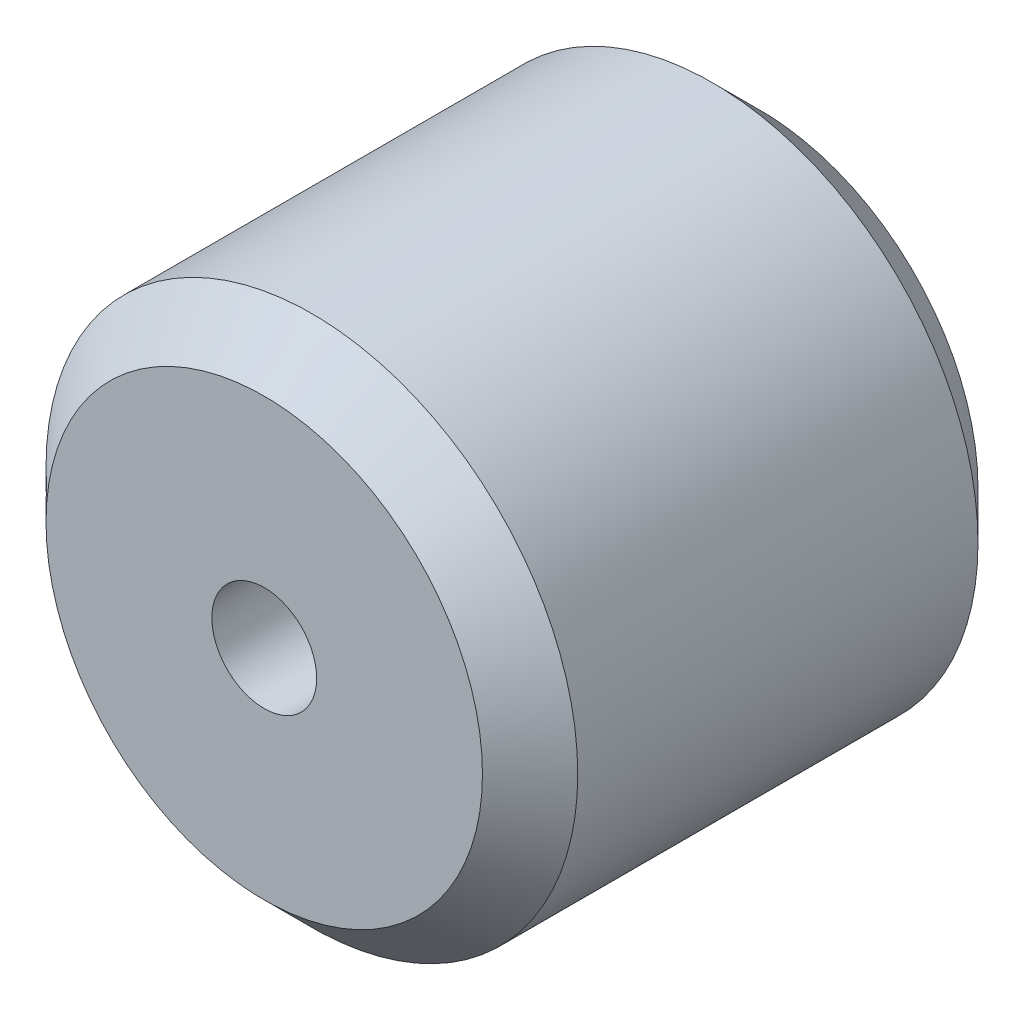
ISO-10303-21;
HEADER;
FILE_DESCRIPTION(('STEP AP214'),'2;1');
FILE_NAME('part.step','',(''),(''),'','','');
FILE_SCHEMA(('AUTOMOTIVE_DESIGN { 1 0 10303 214 1 1 1 1 }'));
ENDSEC;
DATA;
#1=APPLICATION_CONTEXT('core data for automotive mechanical design processes');
#2=APPLICATION_PROTOCOL_DEFINITION('international standard','automotive_design',2000,#1);
#3=PRODUCT_CONTEXT('',#1,'mechanical');
#4=PRODUCT('Part','Part','',(#3));
#5=PRODUCT_RELATED_PRODUCT_CATEGORY('part','',(#4));
#6=PRODUCT_DEFINITION_FORMATION('','',#4);
#7=PRODUCT_DEFINITION_CONTEXT('part definition',#1,'design');
#8=PRODUCT_DEFINITION('design','',#6,#7);
#9=PRODUCT_DEFINITION_SHAPE('','',#8);
#10=(LENGTH_UNIT() NAMED_UNIT(*) SI_UNIT(.MILLI.,.METRE.));
#11=(NAMED_UNIT(*) PLANE_ANGLE_UNIT() SI_UNIT($,.RADIAN.));
#12=(NAMED_UNIT(*) SI_UNIT($,.STERADIAN.) SOLID_ANGLE_UNIT());
#13=UNCERTAINTY_MEASURE_WITH_UNIT(LENGTH_MEASURE(1.E-05),#10,'distance_accuracy_value','');
#14=(GEOMETRIC_REPRESENTATION_CONTEXT(3) GLOBAL_UNCERTAINTY_ASSIGNED_CONTEXT((#13)) GLOBAL_UNIT_ASSIGNED_CONTEXT((#10,
#11,#12)) REPRESENTATION_CONTEXT('',''));
#15=CARTESIAN_POINT('',(0.,0.,0.));
#16=DIRECTION('',(0.,0.,1.));
#17=DIRECTION('',(1.,0.,0.));
#18=AXIS2_PLACEMENT_3D('',#15,#16,#17);
#19=CARTESIAN_POINT('',(0.,0.,0.));
#20=DIRECTION('',(0.,0.,1.));
#21=DIRECTION('',(-1.,0.,0.));
#22=AXIS2_PLACEMENT_3D('',#19,#20,#21);
#23=CYLINDRICAL_SURFACE('',#22,3.4925);
#24=CARTESIAN_POINT('',(0.,0.,33.02));
#25=DIRECTION('',(0.,0.,-1.));
#26=DIRECTION('',(-1.,0.,0.));
#27=AXIS2_PLACEMENT_3D('',#24,#25,#26);
#28=CIRCLE('',#27,3.4925);
#29=CARTESIAN_POINT('',(3.4925,0.,33.02));
#30=VERTEX_POINT('',#29);
#31=EDGE_CURVE('E25',#30,#30,#28,.T.);
#32=ORIENTED_EDGE('',*,*,#31,.F.);
#33=DIRECTION('',(0.,0.,-1.));
#34=VECTOR('',#33,1.);
#35=CARTESIAN_POINT('',(3.4925,0.,0.));
#36=LINE('',#35,#34);
#37=CARTESIAN_POINT('',(3.4925,0.,0.));
#38=VERTEX_POINT('',#37);
#39=EDGE_CURVE('E11',#30,#38,#36,.T.);
#40=ORIENTED_EDGE('',*,*,#39,.T.);
#41=CARTESIAN_POINT('',(0.,0.,0.));
#42=DIRECTION('',(0.,0.,-1.));
#43=DIRECTION('',(-1.,0.,0.));
#44=AXIS2_PLACEMENT_3D('',#41,#42,#43);
#45=CIRCLE('',#44,3.4925);
#46=EDGE_CURVE('E81',#38,#38,#45,.T.);
#47=ORIENTED_EDGE('',*,*,#46,.T.);
#48=ORIENTED_EDGE('',*,*,#39,.F.);
#49=EDGE_LOOP('',(#32,#40,#47,#48));
#50=FACE_BOUND('',#49,.T.);
#51=ADVANCED_FACE('F17',(#50),#23,.F.);
#52=CARTESIAN_POINT('',(0.,0.,33.02));
#53=DIRECTION('',(0.,0.,1.));
#54=DIRECTION('',(1.,0.,0.));
#55=AXIS2_PLACEMENT_3D('',#52,#53,#54);
#56=PLANE('',#55);
#57=ORIENTED_EDGE('',*,*,#31,.T.);
#58=EDGE_LOOP('',(#57));
#59=FACE_BOUND('',#58,.T.);
#60=CARTESIAN_POINT('',(0.,0.,33.02));
#61=DIRECTION('',(0.,0.,-1.));
#62=DIRECTION('',(-1.,0.,0.));
#63=AXIS2_PLACEMENT_3D('',#60,#61,#62);
#64=CIRCLE('',#63,14.5415);
#65=CARTESIAN_POINT('',(14.5415,0.,33.02));
#66=VERTEX_POINT('',#65);
#67=EDGE_CURVE('E104',#66,#66,#64,.T.);
#68=ORIENTED_EDGE('',*,*,#67,.F.);
#69=EDGE_LOOP('',(#68));
#70=FACE_BOUND('',#69,.T.);
#71=ADVANCED_FACE('F184',(#59,#70),#56,.T.);
#72=CARTESIAN_POINT('',(0.,0.,31.4325));
#73=DIRECTION('',(0.,0.,-1.));
#74=DIRECTION('',(-1.,0.,0.));
#75=AXIS2_PLACEMENT_3D('',#72,#73,#74);
#76=CONICAL_SURFACE('',#75,16.129,0.785398163397449);
#77=ORIENTED_EDGE('',*,*,#67,.T.);
#78=DIRECTION('',(0.707106781186548,0.,-0.707106781186547));
#79=VECTOR('',#78,1.);
#80=CARTESIAN_POINT('',(16.129,0.,31.4325));
#81=LINE('',#80,#79);
#82=CARTESIAN_POINT('',(17.7165,0.,29.845));
#83=VERTEX_POINT('',#82);
#84=EDGE_CURVE('E45',#66,#83,#81,.T.);
#85=ORIENTED_EDGE('',*,*,#84,.T.);
#86=CARTESIAN_POINT('',(0.,0.,29.845));
#87=DIRECTION('',(0.,0.,1.));
#88=DIRECTION('',(-1.,0.,0.));
#89=AXIS2_PLACEMENT_3D('',#86,#87,#88);
#90=CIRCLE('',#89,17.7165);
#91=CARTESIAN_POINT('',(-17.7165,0.,29.845));
#92=VERTEX_POINT('',#91);
#93=EDGE_CURVE('E75',#83,#92,#90,.T.);
#94=ORIENTED_EDGE('',*,*,#93,.T.);
#95=CARTESIAN_POINT('',(0.,0.,29.845));
#96=DIRECTION('',(0.,0.,1.));
#97=DIRECTION('',(-1.,0.,0.));
#98=AXIS2_PLACEMENT_3D('',#95,#96,#97);
#99=CIRCLE('',#98,17.7165);
#100=EDGE_CURVE('E82',#92,#83,#99,.T.);
#101=ORIENTED_EDGE('',*,*,#100,.T.);
#102=ORIENTED_EDGE('',*,*,#84,.F.);
#103=EDGE_LOOP('',(#77,#85,#94,#101,#102));
#104=FACE_BOUND('',#103,.T.);
#105=ADVANCED_FACE('F86',(#104),#76,.T.);
#106=CARTESIAN_POINT('',(0.,0.,0.));
#107=DIRECTION('',(0.,0.,1.));
#108=DIRECTION('',(1.,0.,0.));
#109=AXIS2_PLACEMENT_3D('',#106,#107,#108);
#110=PLANE('',#109);
#111=ORIENTED_EDGE('',*,*,#46,.F.);
#112=EDGE_LOOP('',(#111));
#113=FACE_BOUND('',#112,.T.);
#114=CARTESIAN_POINT('',(0.,0.,0.));
#115=DIRECTION('',(0.,0.,1.));
#116=DIRECTION('',(-1.,0.,0.));
#117=AXIS2_PLACEMENT_3D('',#114,#115,#116);
#118=CIRCLE('',#117,14.5415);
#119=CARTESIAN_POINT('',(14.5415,0.,0.));
#120=VERTEX_POINT('',#119);
#121=EDGE_CURVE('E88',#120,#120,#118,.T.);
#122=ORIENTED_EDGE('',*,*,#121,.F.);
#123=EDGE_LOOP('',(#122));
#124=FACE_BOUND('',#123,.T.);
#125=ADVANCED_FACE('F166',(#113,#124),#110,.F.);
#126=CARTESIAN_POINT('',(0.,0.,0.));
#127=DIRECTION('',(0.,0.,1.));
#128=DIRECTION('',(1.,0.,0.));
#129=AXIS2_PLACEMENT_3D('',#126,#127,#128);
#130=CYLINDRICAL_SURFACE('',#129,17.7165);
#131=ORIENTED_EDGE('',*,*,#93,.F.);
#132=ORIENTED_EDGE('',*,*,#100,.F.);
#133=DIRECTION('',(0.,0.,-1.));
#134=VECTOR('',#133,1.);
#135=CARTESIAN_POINT('',(-17.7165,0.,0.));
#136=LINE('',#135,#134);
#137=CARTESIAN_POINT('',(-17.7165,0.,3.175));
#138=VERTEX_POINT('',#137);
#139=EDGE_CURVE('E71',#92,#138,#136,.T.);
#140=ORIENTED_EDGE('',*,*,#139,.T.);
#141=CARTESIAN_POINT('',(0.,0.,3.175));
#142=DIRECTION('',(0.,0.,-1.));
#143=DIRECTION('',(-1.,0.,0.));
#144=AXIS2_PLACEMENT_3D('',#141,#142,#143);
#145=CIRCLE('',#144,17.7165);
#146=CARTESIAN_POINT('',(17.7165,0.,3.175));
#147=VERTEX_POINT('',#146);
#148=EDGE_CURVE('E97',#147,#138,#145,.T.);
#149=ORIENTED_EDGE('',*,*,#148,.F.);
#150=CARTESIAN_POINT('',(0.,0.,3.175));
#151=DIRECTION('',(0.,0.,-1.));
#152=DIRECTION('',(-1.,0.,0.));
#153=AXIS2_PLACEMENT_3D('',#150,#151,#152);
#154=CIRCLE('',#153,17.7165);
#155=EDGE_CURVE('E78',#138,#147,#154,.T.);
#156=ORIENTED_EDGE('',*,*,#155,.F.);
#157=ORIENTED_EDGE('',*,*,#139,.F.);
#158=EDGE_LOOP('',(#131,#132,#140,#149,#156,#157));
#159=FACE_BOUND('',#158,.T.);
#160=ADVANCED_FACE('F73',(#159),#130,.T.);
#161=CARTESIAN_POINT('',(0.,0.,1.5875));
#162=DIRECTION('',(0.,0.,1.));
#163=DIRECTION('',(-1.,0.,0.));
#164=AXIS2_PLACEMENT_3D('',#161,#162,#163);
#165=CONICAL_SURFACE('',#164,16.129,0.785398163397448);
#166=ORIENTED_EDGE('',*,*,#148,.T.);
#167=ORIENTED_EDGE('',*,*,#155,.T.);
#168=DIRECTION('',(-0.707106781186548,0.,-0.707106781186547));
#169=VECTOR('',#168,1.);
#170=CARTESIAN_POINT('',(16.129,0.,1.5875));
#171=LINE('',#170,#169);
#172=EDGE_CURVE('E94',#147,#120,#171,.T.);
#173=ORIENTED_EDGE('',*,*,#172,.T.);
#174=ORIENTED_EDGE('',*,*,#121,.T.);
#175=ORIENTED_EDGE('',*,*,#172,.F.);
#176=EDGE_LOOP('',(#166,#167,#173,#174,#175));
#177=FACE_BOUND('',#176,.T.);
#178=ADVANCED_FACE('F151',(#177),#165,.T.);
#179=CLOSED_SHELL('',(#51,#71,#105,#125,#160,#178));
#180=MANIFOLD_SOLID_BREP('B1',#179);
#181=ADVANCED_BREP_SHAPE_REPRESENTATION('',(#18,#180),#14);
#182=SHAPE_DEFINITION_REPRESENTATION(#9,#181);
ENDSEC;
END-ISO-10303-21;
